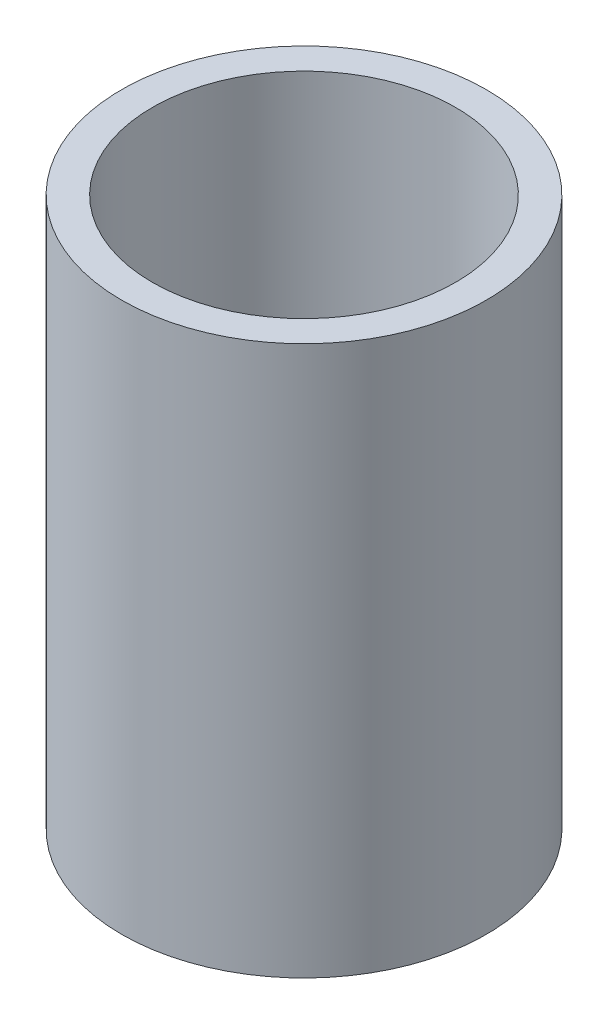
ISO-10303-21;
HEADER;
FILE_DESCRIPTION(('STEP AP214'),'2;1');
FILE_NAME('part.step','',(''),(''),'','','');
FILE_SCHEMA(('AUTOMOTIVE_DESIGN { 1 0 10303 214 1 1 1 1 }'));
ENDSEC;
DATA;
#1=APPLICATION_CONTEXT('core data for automotive mechanical design processes');
#2=APPLICATION_PROTOCOL_DEFINITION('international standard','automotive_design',2000,#1);
#3=PRODUCT_CONTEXT('',#1,'mechanical');
#4=PRODUCT('Part','Part','',(#3));
#5=PRODUCT_RELATED_PRODUCT_CATEGORY('part','',(#4));
#6=PRODUCT_DEFINITION_FORMATION('','',#4);
#7=PRODUCT_DEFINITION_CONTEXT('part definition',#1,'design');
#8=PRODUCT_DEFINITION('design','',#6,#7);
#9=PRODUCT_DEFINITION_SHAPE('','',#8);
#10=(LENGTH_UNIT() NAMED_UNIT(*) SI_UNIT(.MILLI.,.METRE.));
#11=(NAMED_UNIT(*) PLANE_ANGLE_UNIT() SI_UNIT($,.RADIAN.));
#12=(NAMED_UNIT(*) SI_UNIT($,.STERADIAN.) SOLID_ANGLE_UNIT());
#13=UNCERTAINTY_MEASURE_WITH_UNIT(LENGTH_MEASURE(1.E-05),#10,'distance_accuracy_value','');
#14=(GEOMETRIC_REPRESENTATION_CONTEXT(3) GLOBAL_UNCERTAINTY_ASSIGNED_CONTEXT((#13)) GLOBAL_UNIT_ASSIGNED_CONTEXT((#10,
#11,#12)) REPRESENTATION_CONTEXT('',''));
#15=CARTESIAN_POINT('',(0.,0.,0.));
#16=DIRECTION('',(0.,0.,1.));
#17=DIRECTION('',(1.,0.,0.));
#18=AXIS2_PLACEMENT_3D('',#15,#16,#17);
#19=CARTESIAN_POINT('',(0.,63.5,0.));
#20=DIRECTION('',(0.,1.,0.));
#21=DIRECTION('',(0.,0.,1.));
#22=AXIS2_PLACEMENT_3D('',#19,#20,#21);
#23=PLANE('',#22);
#24=CARTESIAN_POINT('',(0.,63.5,0.));
#25=DIRECTION('',(0.,1.,0.));
#26=DIRECTION('',(0.,0.,1.));
#27=AXIS2_PLACEMENT_3D('',#24,#25,#26);
#28=CIRCLE('',#27,21.082);
#29=CARTESIAN_POINT('',(0.,63.5,21.082));
#30=VERTEX_POINT('',#29);
#31=EDGE_CURVE('E10',#30,#30,#28,.T.);
#32=ORIENTED_EDGE('',*,*,#31,.T.);
#33=EDGE_LOOP('',(#32));
#34=FACE_BOUND('',#33,.T.);
#35=CARTESIAN_POINT('',(0.,63.5,0.));
#36=DIRECTION('',(0.,1.,0.));
#37=DIRECTION('',(0.,0.,1.));
#38=AXIS2_PLACEMENT_3D('',#35,#36,#37);
#39=CIRCLE('',#38,17.526);
#40=CARTESIAN_POINT('',(0.,63.5,17.526));
#41=VERTEX_POINT('',#40);
#42=EDGE_CURVE('E48',#41,#41,#39,.T.);
#43=ORIENTED_EDGE('',*,*,#42,.F.);
#44=EDGE_LOOP('',(#43));
#45=FACE_BOUND('',#44,.T.);
#46=ADVANCED_FACE('F37',(#34,#45),#23,.T.);
#47=CARTESIAN_POINT('',(0.,0.,0.));
#48=DIRECTION('',(0.,1.,0.));
#49=DIRECTION('',(0.,0.,1.));
#50=AXIS2_PLACEMENT_3D('',#47,#48,#49);
#51=PLANE('',#50);
#52=CARTESIAN_POINT('',(0.,0.,0.));
#53=DIRECTION('',(0.,1.,0.));
#54=DIRECTION('',(0.,0.,1.));
#55=AXIS2_PLACEMENT_3D('',#52,#53,#54);
#56=CIRCLE('',#55,21.082);
#57=CARTESIAN_POINT('',(0.,0.,21.082));
#58=VERTEX_POINT('',#57);
#59=EDGE_CURVE('E41',#58,#58,#56,.T.);
#60=ORIENTED_EDGE('',*,*,#59,.F.);
#61=EDGE_LOOP('',(#60));
#62=FACE_BOUND('',#61,.T.);
#63=CARTESIAN_POINT('',(0.,0.,0.));
#64=DIRECTION('',(0.,1.,0.));
#65=DIRECTION('',(0.,0.,1.));
#66=AXIS2_PLACEMENT_3D('',#63,#64,#65);
#67=CIRCLE('',#66,17.526);
#68=CARTESIAN_POINT('',(0.,0.,17.526));
#69=VERTEX_POINT('',#68);
#70=EDGE_CURVE('E50',#69,#69,#67,.T.);
#71=ORIENTED_EDGE('',*,*,#70,.T.);
#72=EDGE_LOOP('',(#71));
#73=FACE_BOUND('',#72,.T.);
#74=ADVANCED_FACE('F60',(#62,#73),#51,.F.);
#75=CARTESIAN_POINT('',(0.,63.5,0.));
#76=DIRECTION('',(0.,-1.,0.));
#77=DIRECTION('',(0.,0.,-1.));
#78=AXIS2_PLACEMENT_3D('',#75,#76,#77);
#79=CYLINDRICAL_SURFACE('',#78,21.082);
#80=ORIENTED_EDGE('',*,*,#31,.F.);
#81=EDGE_LOOP('',(#80));
#82=FACE_BOUND('',#81,.T.);
#83=ORIENTED_EDGE('',*,*,#59,.T.);
#84=EDGE_LOOP('',(#83));
#85=FACE_BOUND('',#84,.T.);
#86=ADVANCED_FACE('F39',(#82,#85),#79,.T.);
#87=CARTESIAN_POINT('',(0.,63.5,0.));
#88=DIRECTION('',(0.,-1.,0.));
#89=DIRECTION('',(0.,0.,-1.));
#90=AXIS2_PLACEMENT_3D('',#87,#88,#89);
#91=CYLINDRICAL_SURFACE('',#90,17.526);
#92=ORIENTED_EDGE('',*,*,#42,.T.);
#93=EDGE_LOOP('',(#92));
#94=FACE_BOUND('',#93,.T.);
#95=ORIENTED_EDGE('',*,*,#70,.F.);
#96=EDGE_LOOP('',(#95));
#97=FACE_BOUND('',#96,.T.);
#98=ADVANCED_FACE('F56',(#94,#97),#91,.F.);
#99=CLOSED_SHELL('',(#46,#74,#86,#98));
#100=MANIFOLD_SOLID_BREP('B2',#99);
#101=ADVANCED_BREP_SHAPE_REPRESENTATION('',(#18,#100),#14);
#102=SHAPE_DEFINITION_REPRESENTATION(#9,#101);
ENDSEC;
END-ISO-10303-21;
